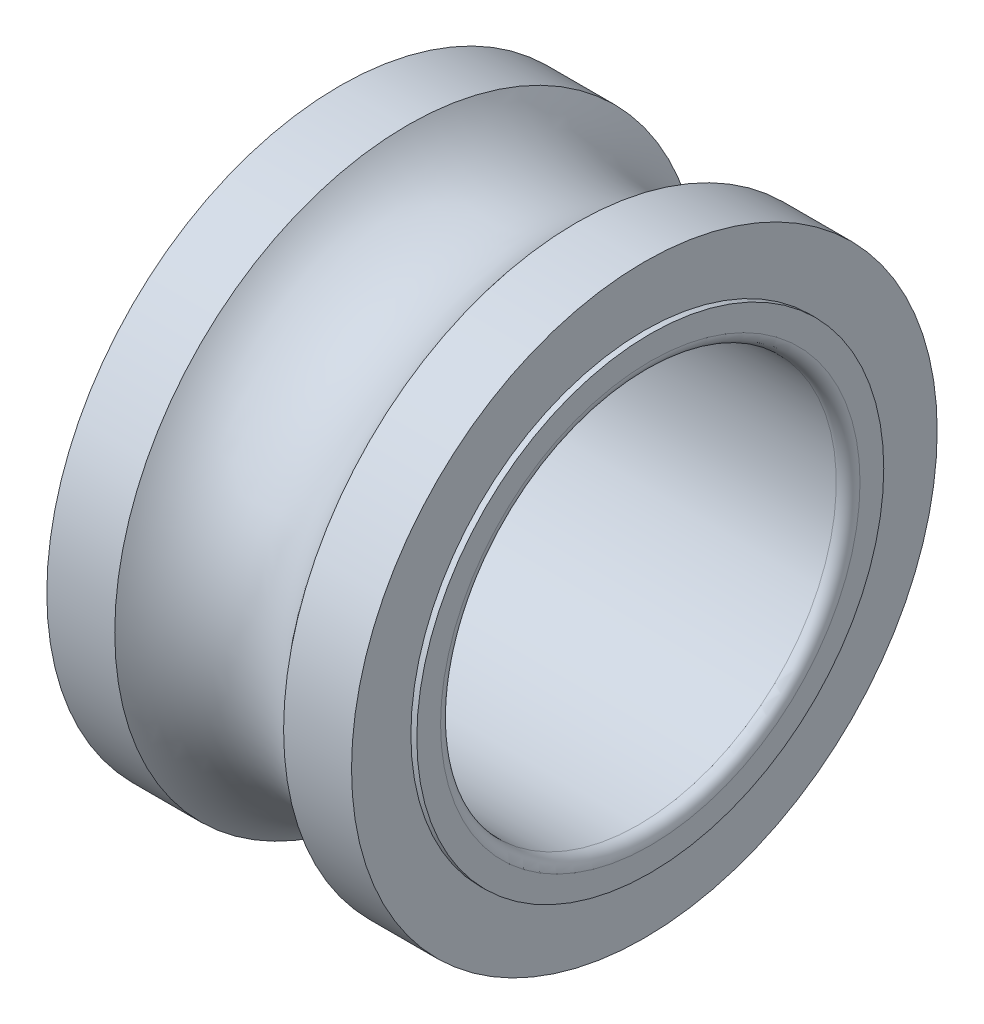
ISO-10303-21;
HEADER;
FILE_DESCRIPTION(('STEP AP214'),'2;1');
FILE_NAME('part.step','',(''),(''),'','','');
FILE_SCHEMA(('AUTOMOTIVE_DESIGN { 1 0 10303 214 1 1 1 1 }'));
ENDSEC;
DATA;
#1=APPLICATION_CONTEXT('core data for automotive mechanical design processes');
#2=APPLICATION_PROTOCOL_DEFINITION('international standard','automotive_design',2000,#1);
#3=PRODUCT_CONTEXT('',#1,'mechanical');
#4=PRODUCT('Part','Part','',(#3));
#5=PRODUCT_RELATED_PRODUCT_CATEGORY('part','',(#4));
#6=PRODUCT_DEFINITION_FORMATION('','',#4);
#7=PRODUCT_DEFINITION_CONTEXT('part definition',#1,'design');
#8=PRODUCT_DEFINITION('design','',#6,#7);
#9=PRODUCT_DEFINITION_SHAPE('','',#8);
#10=(LENGTH_UNIT() NAMED_UNIT(*) SI_UNIT(.MILLI.,.METRE.));
#11=(NAMED_UNIT(*) PLANE_ANGLE_UNIT() SI_UNIT($,.RADIAN.));
#12=(NAMED_UNIT(*) SI_UNIT($,.STERADIAN.) SOLID_ANGLE_UNIT());
#13=UNCERTAINTY_MEASURE_WITH_UNIT(LENGTH_MEASURE(1.E-05),#10,'distance_accuracy_value','');
#14=(GEOMETRIC_REPRESENTATION_CONTEXT(3) GLOBAL_UNCERTAINTY_ASSIGNED_CONTEXT((#13)) GLOBAL_UNIT_ASSIGNED_CONTEXT((#10,
#11,#12)) REPRESENTATION_CONTEXT('',''));
#15=CARTESIAN_POINT('',(0.,0.,0.));
#16=DIRECTION('',(0.,0.,1.));
#17=DIRECTION('',(1.,0.,0.));
#18=AXIS2_PLACEMENT_3D('',#15,#16,#17);
#19=CARTESIAN_POINT('',(0.,0.,0.));
#20=DIRECTION('',(-1.,0.,0.));
#21=DIRECTION('',(0.,1.,0.));
#22=AXIS2_PLACEMENT_3D('',#19,#20,#21);
#23=CYLINDRICAL_SURFACE('',#22,5.);
#24=CARTESIAN_POINT('',(3.7,0.,0.));
#25=DIRECTION('',(1.,0.,0.));
#26=DIRECTION('',(0.,1.,0.));
#27=AXIS2_PLACEMENT_3D('',#24,#25,#26);
#28=CIRCLE('',#27,5.);
#29=CARTESIAN_POINT('',(3.7,5.,0.));
#30=VERTEX_POINT('',#29);
#31=EDGE_CURVE('E11',#30,#30,#28,.T.);
#32=ORIENTED_EDGE('',*,*,#31,.T.);
#33=EDGE_LOOP('',(#32));
#34=FACE_BOUND('',#33,.T.);
#35=CARTESIAN_POINT('',(-3.7,0.,0.));
#36=DIRECTION('',(1.,0.,0.));
#37=DIRECTION('',(0.,1.,0.));
#38=AXIS2_PLACEMENT_3D('',#35,#36,#37);
#39=CIRCLE('',#38,5.);
#40=CARTESIAN_POINT('',(-3.7,5.,0.));
#41=VERTEX_POINT('',#40);
#42=EDGE_CURVE('E65',#41,#41,#39,.T.);
#43=ORIENTED_EDGE('',*,*,#42,.F.);
#44=EDGE_LOOP('',(#43));
#45=FACE_BOUND('',#44,.T.);
#46=ADVANCED_FACE('F16',(#34,#45),#23,.F.);
#47=CARTESIAN_POINT('',(3.7,0.,0.));
#48=DIRECTION('',(1.,0.,0.));
#49=DIRECTION('',(0.,0.,-1.));
#50=AXIS2_PLACEMENT_3D('',#47,#48,#49);
#51=TOROIDAL_SURFACE('',#50,5.3,0.3);
#52=CARTESIAN_POINT('',(4.,0.,0.));
#53=DIRECTION('',(1.,0.,0.));
#54=DIRECTION('',(0.,1.,0.));
#55=AXIS2_PLACEMENT_3D('',#52,#53,#54);
#56=CIRCLE('',#55,5.3);
#57=CARTESIAN_POINT('',(4.,5.3,0.));
#58=VERTEX_POINT('',#57);
#59=EDGE_CURVE('E24',#58,#58,#56,.T.);
#60=ORIENTED_EDGE('',*,*,#59,.T.);
#61=EDGE_LOOP('',(#60));
#62=FACE_BOUND('',#61,.T.);
#63=ORIENTED_EDGE('',*,*,#31,.F.);
#64=EDGE_LOOP('',(#63));
#65=FACE_BOUND('',#64,.T.);
#66=ADVANCED_FACE('F116',(#62,#65),#51,.T.);
#67=CARTESIAN_POINT('',(4.,6.35,0.));
#68=DIRECTION('',(1.,0.,0.));
#69=DIRECTION('',(0.,1.,0.));
#70=AXIS2_PLACEMENT_3D('',#67,#68,#69);
#71=PLANE('',#70);
#72=ORIENTED_EDGE('',*,*,#59,.F.);
#73=EDGE_LOOP('',(#72));
#74=FACE_BOUND('',#73,.T.);
#75=CARTESIAN_POINT('',(4.,0.,0.));
#76=DIRECTION('',(1.,0.,0.));
#77=DIRECTION('',(0.,0.,-1.));
#78=AXIS2_PLACEMENT_3D('',#75,#76,#77);
#79=CIRCLE('',#78,5.9);
#80=CARTESIAN_POINT('',(4.,0.,5.9));
#81=VERTEX_POINT('',#80);
#82=EDGE_CURVE('E71',#81,#81,#79,.T.);
#83=ORIENTED_EDGE('',*,*,#82,.T.);
#84=EDGE_LOOP('',(#83));
#85=FACE_BOUND('',#84,.T.);
#86=ADVANCED_FACE('F105',(#74,#85),#71,.T.);
#87=CARTESIAN_POINT('',(0.,0.,0.));
#88=DIRECTION('',(-1.,0.,0.));
#89=DIRECTION('',(0.,1.,0.));
#90=AXIS2_PLACEMENT_3D('',#87,#88,#89);
#91=CYLINDRICAL_SURFACE('',#90,7.4);
#92=CARTESIAN_POINT('',(2.13333333333333,0.,0.));
#93=DIRECTION('',(1.,0.,0.));
#94=DIRECTION('',(0.,1.,0.));
#95=AXIS2_PLACEMENT_3D('',#92,#93,#94);
#96=CIRCLE('',#95,7.4);
#97=CARTESIAN_POINT('',(2.13333333333333,-7.4,0.));
#98=VERTEX_POINT('',#97);
#99=EDGE_CURVE('E63',#98,#98,#96,.T.);
#100=ORIENTED_EDGE('',*,*,#99,.T.);
#101=EDGE_LOOP('',(#100));
#102=FACE_BOUND('',#101,.T.);
#103=CARTESIAN_POINT('',(3.85,0.,0.));
#104=DIRECTION('',(-1.,0.,0.));
#105=DIRECTION('',(0.,1.,0.));
#106=AXIS2_PLACEMENT_3D('',#103,#104,#105);
#107=CIRCLE('',#106,7.4);
#108=CARTESIAN_POINT('',(3.85,-7.4,0.));
#109=VERTEX_POINT('',#108);
#110=EDGE_CURVE('E67',#109,#109,#107,.T.);
#111=ORIENTED_EDGE('',*,*,#110,.T.);
#112=EDGE_LOOP('',(#111));
#113=FACE_BOUND('',#112,.T.);
#114=ADVANCED_FACE('F102',(#102,#113),#91,.T.);
#115=CARTESIAN_POINT('',(-4.,6.35,0.));
#116=DIRECTION('',(-1.,0.,0.));
#117=DIRECTION('',(0.,-1.,0.));
#118=AXIS2_PLACEMENT_3D('',#115,#116,#117);
#119=PLANE('',#118);
#120=CARTESIAN_POINT('',(-4.,0.,0.));
#121=DIRECTION('',(1.,0.,0.));
#122=DIRECTION('',(0.,1.,0.));
#123=AXIS2_PLACEMENT_3D('',#120,#121,#122);
#124=CIRCLE('',#123,5.3);
#125=CARTESIAN_POINT('',(-4.,5.3,0.));
#126=VERTEX_POINT('',#125);
#127=EDGE_CURVE('E62',#126,#126,#124,.T.);
#128=ORIENTED_EDGE('',*,*,#127,.T.);
#129=EDGE_LOOP('',(#128));
#130=FACE_BOUND('',#129,.T.);
#131=CARTESIAN_POINT('',(-4.,0.,0.));
#132=DIRECTION('',(-1.,0.,0.));
#133=DIRECTION('',(0.,0.,1.));
#134=AXIS2_PLACEMENT_3D('',#131,#132,#133);
#135=CIRCLE('',#134,5.9);
#136=CARTESIAN_POINT('',(-4.,0.,-5.9));
#137=VERTEX_POINT('',#136);
#138=EDGE_CURVE('E77',#137,#137,#135,.T.);
#139=ORIENTED_EDGE('',*,*,#138,.T.);
#140=EDGE_LOOP('',(#139));
#141=FACE_BOUND('',#140,.T.);
#142=ADVANCED_FACE('F104',(#130,#141),#119,.T.);
#143=CARTESIAN_POINT('',(-3.7,0.,0.));
#144=DIRECTION('',(1.,0.,0.));
#145=DIRECTION('',(0.,0.,-1.));
#146=AXIS2_PLACEMENT_3D('',#143,#144,#145);
#147=TOROIDAL_SURFACE('',#146,5.3,0.3);
#148=ORIENTED_EDGE('',*,*,#42,.T.);
#149=EDGE_LOOP('',(#148));
#150=FACE_BOUND('',#149,.T.);
#151=ORIENTED_EDGE('',*,*,#127,.F.);
#152=EDGE_LOOP('',(#151));
#153=FACE_BOUND('',#152,.T.);
#154=ADVANCED_FACE('F113',(#150,#153),#147,.T.);
#155=CARTESIAN_POINT('',(0.,0.,0.));
#156=DIRECTION('',(-1.,0.,0.));
#157=DIRECTION('',(0.,1.,0.));
#158=AXIS2_PLACEMENT_3D('',#155,#156,#157);
#159=CYLINDRICAL_SURFACE('',#158,7.4);
#160=CARTESIAN_POINT('',(-2.13333333333333,0.,0.));
#161=DIRECTION('',(-1.,0.,0.));
#162=DIRECTION('',(0.,1.,0.));
#163=AXIS2_PLACEMENT_3D('',#160,#161,#162);
#164=CIRCLE('',#163,7.4);
#165=CARTESIAN_POINT('',(-2.13333333333333,-7.4,0.));
#166=VERTEX_POINT('',#165);
#167=EDGE_CURVE('E58',#166,#166,#164,.T.);
#168=ORIENTED_EDGE('',*,*,#167,.T.);
#169=EDGE_LOOP('',(#168));
#170=FACE_BOUND('',#169,.T.);
#171=CARTESIAN_POINT('',(-3.85,0.,0.));
#172=DIRECTION('',(1.,0.,0.));
#173=DIRECTION('',(0.,1.,0.));
#174=AXIS2_PLACEMENT_3D('',#171,#172,#173);
#175=CIRCLE('',#174,7.4);
#176=CARTESIAN_POINT('',(-3.85,-7.4,0.));
#177=VERTEX_POINT('',#176);
#178=EDGE_CURVE('E73',#177,#177,#175,.T.);
#179=ORIENTED_EDGE('',*,*,#178,.T.);
#180=EDGE_LOOP('',(#179));
#181=FACE_BOUND('',#180,.T.);
#182=ADVANCED_FACE('F59',(#170,#181),#159,.T.);
#183=CARTESIAN_POINT('',(0.,0.,0.));
#184=DIRECTION('',(1.,0.,0.));
#185=DIRECTION('',(0.,0.,-1.));
#186=AXIS2_PLACEMENT_3D('',#183,#184,#185);
#187=TOROIDAL_SURFACE('',#186,9.,2.66666666666666);
#188=ORIENTED_EDGE('',*,*,#167,.F.);
#189=EDGE_LOOP('',(#188));
#190=FACE_BOUND('',#189,.T.);
#191=ORIENTED_EDGE('',*,*,#99,.F.);
#192=EDGE_LOOP('',(#191));
#193=FACE_BOUND('',#192,.T.);
#194=ADVANCED_FACE('F98',(#190,#193),#187,.F.);
#195=CARTESIAN_POINT('',(3.85,0.,0.));
#196=DIRECTION('',(-1.,0.,0.));
#197=DIRECTION('',(0.,0.,1.));
#198=AXIS2_PLACEMENT_3D('',#195,#196,#197);
#199=PLANE('',#198);
#200=CARTESIAN_POINT('',(3.85,0.,0.));
#201=DIRECTION('',(1.,0.,0.));
#202=DIRECTION('',(0.,0.,-1.));
#203=AXIS2_PLACEMENT_3D('',#200,#201,#202);
#204=CIRCLE('',#203,5.9);
#205=CARTESIAN_POINT('',(3.85,0.,5.9));
#206=VERTEX_POINT('',#205);
#207=EDGE_CURVE('E72',#206,#206,#204,.T.);
#208=ORIENTED_EDGE('',*,*,#207,.F.);
#209=EDGE_LOOP('',(#208));
#210=FACE_BOUND('',#209,.T.);
#211=ORIENTED_EDGE('',*,*,#110,.F.);
#212=EDGE_LOOP('',(#211));
#213=FACE_BOUND('',#212,.T.);
#214=ADVANCED_FACE('F95',(#210,#213),#199,.F.);
#215=CARTESIAN_POINT('',(4.425,0.,0.));
#216=DIRECTION('',(-1.,0.,0.));
#217=DIRECTION('',(0.,0.,-1.));
#218=AXIS2_PLACEMENT_3D('',#215,#216,#217);
#219=CYLINDRICAL_SURFACE('',#218,5.9);
#220=ORIENTED_EDGE('',*,*,#207,.T.);
#221=EDGE_LOOP('',(#220));
#222=FACE_BOUND('',#221,.T.);
#223=ORIENTED_EDGE('',*,*,#82,.F.);
#224=EDGE_LOOP('',(#223));
#225=FACE_BOUND('',#224,.T.);
#226=ADVANCED_FACE('F92',(#222,#225),#219,.T.);
#227=CARTESIAN_POINT('',(-3.85,0.,0.));
#228=DIRECTION('',(1.,0.,0.));
#229=DIRECTION('',(0.,0.,-1.));
#230=AXIS2_PLACEMENT_3D('',#227,#228,#229);
#231=PLANE('',#230);
#232=CARTESIAN_POINT('',(-3.85,0.,0.));
#233=DIRECTION('',(-1.,0.,0.));
#234=DIRECTION('',(0.,0.,1.));
#235=AXIS2_PLACEMENT_3D('',#232,#233,#234);
#236=CIRCLE('',#235,5.9);
#237=CARTESIAN_POINT('',(-3.85,0.,-5.9));
#238=VERTEX_POINT('',#237);
#239=EDGE_CURVE('E74',#238,#238,#236,.T.);
#240=ORIENTED_EDGE('',*,*,#239,.F.);
#241=EDGE_LOOP('',(#240));
#242=FACE_BOUND('',#241,.T.);
#243=ORIENTED_EDGE('',*,*,#178,.F.);
#244=EDGE_LOOP('',(#243));
#245=FACE_BOUND('',#244,.T.);
#246=ADVANCED_FACE('F130',(#242,#245),#231,.F.);
#247=CARTESIAN_POINT('',(-4.425,0.,0.));
#248=DIRECTION('',(1.,0.,0.));
#249=DIRECTION('',(0.,0.,1.));
#250=AXIS2_PLACEMENT_3D('',#247,#248,#249);
#251=CYLINDRICAL_SURFACE('',#250,5.9);
#252=ORIENTED_EDGE('',*,*,#239,.T.);
#253=EDGE_LOOP('',(#252));
#254=FACE_BOUND('',#253,.T.);
#255=ORIENTED_EDGE('',*,*,#138,.F.);
#256=EDGE_LOOP('',(#255));
#257=FACE_BOUND('',#256,.T.);
#258=ADVANCED_FACE('F133',(#254,#257),#251,.T.);
#259=CLOSED_SHELL('',(#46,#66,#86,#114,#142,#154,#182,#194,#214,#226,#246,#258));
#260=MANIFOLD_SOLID_BREP('B1',#259);
#261=ADVANCED_BREP_SHAPE_REPRESENTATION('',(#18,#260),#14);
#262=SHAPE_DEFINITION_REPRESENTATION(#9,#261);
ENDSEC;
END-ISO-10303-21;
